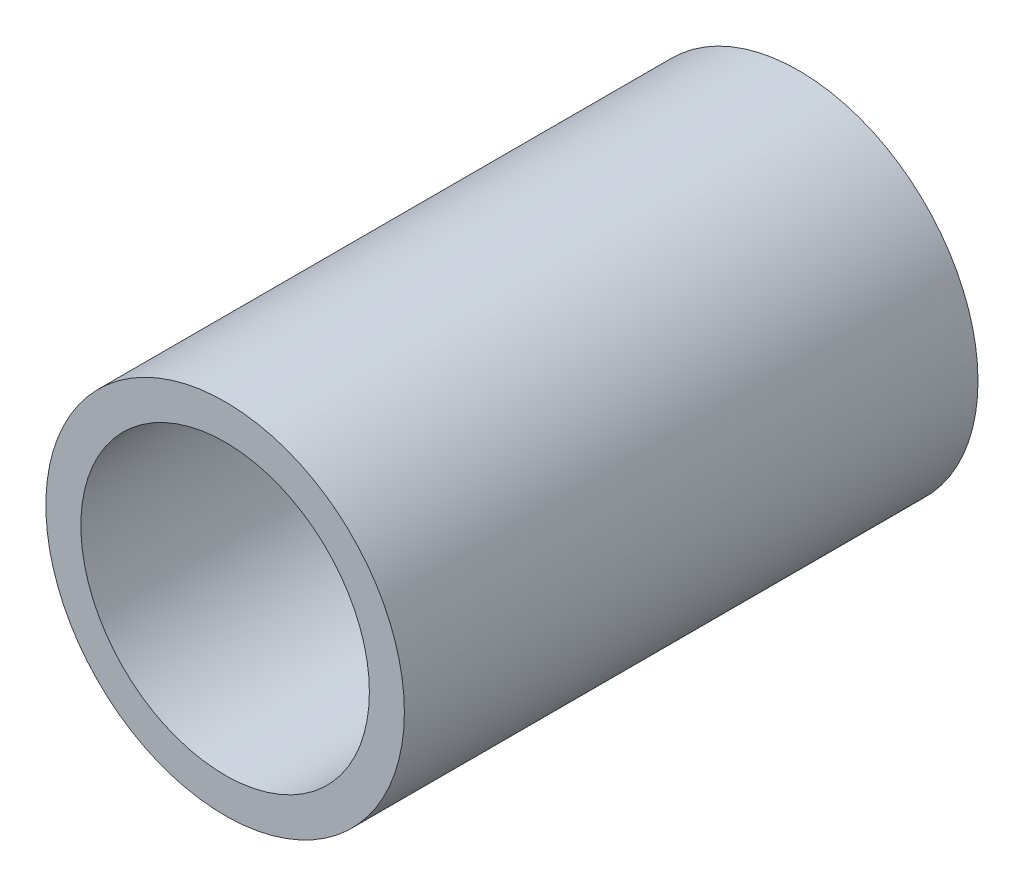
ISO-10303-21;
HEADER;
FILE_DESCRIPTION(('STEP AP214'),'2;1');
FILE_NAME('part.step','',(''),(''),'','','');
FILE_SCHEMA(('AUTOMOTIVE_DESIGN { 1 0 10303 214 1 1 1 1 }'));
ENDSEC;
DATA;
#1=APPLICATION_CONTEXT('core data for automotive mechanical design processes');
#2=APPLICATION_PROTOCOL_DEFINITION('international standard','automotive_design',2000,#1);
#3=PRODUCT_CONTEXT('',#1,'mechanical');
#4=PRODUCT('Part','Part','',(#3));
#5=PRODUCT_RELATED_PRODUCT_CATEGORY('part','',(#4));
#6=PRODUCT_DEFINITION_FORMATION('','',#4);
#7=PRODUCT_DEFINITION_CONTEXT('part definition',#1,'design');
#8=PRODUCT_DEFINITION('design','',#6,#7);
#9=PRODUCT_DEFINITION_SHAPE('','',#8);
#10=(LENGTH_UNIT() NAMED_UNIT(*) SI_UNIT(.MILLI.,.METRE.));
#11=(NAMED_UNIT(*) PLANE_ANGLE_UNIT() SI_UNIT($,.RADIAN.));
#12=(NAMED_UNIT(*) SI_UNIT($,.STERADIAN.) SOLID_ANGLE_UNIT());
#13=UNCERTAINTY_MEASURE_WITH_UNIT(LENGTH_MEASURE(1.E-05),#10,'distance_accuracy_value','');
#14=(GEOMETRIC_REPRESENTATION_CONTEXT(3) GLOBAL_UNCERTAINTY_ASSIGNED_CONTEXT((#13)) GLOBAL_UNIT_ASSIGNED_CONTEXT((#10,
#11,#12)) REPRESENTATION_CONTEXT('',''));
#15=CARTESIAN_POINT('',(0.,0.,0.));
#16=DIRECTION('',(0.,0.,1.));
#17=DIRECTION('',(1.,0.,0.));
#18=AXIS2_PLACEMENT_3D('',#15,#16,#17);
#19=CARTESIAN_POINT('',(0.,0.,12.7));
#20=DIRECTION('',(0.,0.,1.));
#21=DIRECTION('',(1.,0.,0.));
#22=AXIS2_PLACEMENT_3D('',#19,#20,#21);
#23=PLANE('',#22);
#24=CARTESIAN_POINT('',(0.,0.,12.7));
#25=DIRECTION('',(0.,0.,1.));
#26=DIRECTION('',(1.,0.,0.));
#27=AXIS2_PLACEMENT_3D('',#24,#25,#26);
#28=CIRCLE('',#27,7.9375);
#29=CARTESIAN_POINT('',(7.9375,0.,12.7));
#30=VERTEX_POINT('',#29);
#31=EDGE_CURVE('E10',#30,#30,#28,.T.);
#32=ORIENTED_EDGE('',*,*,#31,.T.);
#33=EDGE_LOOP('',(#32));
#34=FACE_BOUND('',#33,.T.);
#35=CARTESIAN_POINT('',(0.,0.,12.7));
#36=DIRECTION('',(0.,0.,1.));
#37=DIRECTION('',(1.,0.,0.));
#38=AXIS2_PLACEMENT_3D('',#35,#36,#37);
#39=CIRCLE('',#38,6.3881);
#40=CARTESIAN_POINT('',(6.3881,0.,12.7));
#41=VERTEX_POINT('',#40);
#42=EDGE_CURVE('E41',#41,#41,#39,.T.);
#43=ORIENTED_EDGE('',*,*,#42,.F.);
#44=EDGE_LOOP('',(#43));
#45=FACE_BOUND('',#44,.T.);
#46=ADVANCED_FACE('F30',(#34,#45),#23,.T.);
#47=CARTESIAN_POINT('',(0.,0.,-12.7));
#48=DIRECTION('',(0.,0.,1.));
#49=DIRECTION('',(1.,0.,0.));
#50=AXIS2_PLACEMENT_3D('',#47,#48,#49);
#51=PLANE('',#50);
#52=CARTESIAN_POINT('',(0.,0.,-12.7));
#53=DIRECTION('',(0.,0.,1.));
#54=DIRECTION('',(1.,0.,0.));
#55=AXIS2_PLACEMENT_3D('',#52,#53,#54);
#56=CIRCLE('',#55,7.9375);
#57=CARTESIAN_POINT('',(7.9375,0.,-12.7));
#58=VERTEX_POINT('',#57);
#59=EDGE_CURVE('E34',#58,#58,#56,.T.);
#60=ORIENTED_EDGE('',*,*,#59,.F.);
#61=EDGE_LOOP('',(#60));
#62=FACE_BOUND('',#61,.T.);
#63=CARTESIAN_POINT('',(0.,0.,-12.7));
#64=DIRECTION('',(0.,0.,1.));
#65=DIRECTION('',(1.,0.,0.));
#66=AXIS2_PLACEMENT_3D('',#63,#64,#65);
#67=CIRCLE('',#66,6.3881);
#68=CARTESIAN_POINT('',(6.3881,0.,-12.7));
#69=VERTEX_POINT('',#68);
#70=EDGE_CURVE('E43',#69,#69,#67,.T.);
#71=ORIENTED_EDGE('',*,*,#70,.T.);
#72=EDGE_LOOP('',(#71));
#73=FACE_BOUND('',#72,.T.);
#74=ADVANCED_FACE('F53',(#62,#73),#51,.F.);
#75=CARTESIAN_POINT('',(0.,0.,12.7));
#76=DIRECTION('',(0.,0.,-1.));
#77=DIRECTION('',(-1.,0.,0.));
#78=AXIS2_PLACEMENT_3D('',#75,#76,#77);
#79=CYLINDRICAL_SURFACE('',#78,7.9375);
#80=ORIENTED_EDGE('',*,*,#31,.F.);
#81=EDGE_LOOP('',(#80));
#82=FACE_BOUND('',#81,.T.);
#83=ORIENTED_EDGE('',*,*,#59,.T.);
#84=EDGE_LOOP('',(#83));
#85=FACE_BOUND('',#84,.T.);
#86=ADVANCED_FACE('F32',(#82,#85),#79,.T.);
#87=CARTESIAN_POINT('',(0.,0.,12.7));
#88=DIRECTION('',(0.,0.,-1.));
#89=DIRECTION('',(-1.,0.,0.));
#90=AXIS2_PLACEMENT_3D('',#87,#88,#89);
#91=CYLINDRICAL_SURFACE('',#90,6.3881);
#92=ORIENTED_EDGE('',*,*,#42,.T.);
#93=EDGE_LOOP('',(#92));
#94=FACE_BOUND('',#93,.T.);
#95=ORIENTED_EDGE('',*,*,#70,.F.);
#96=EDGE_LOOP('',(#95));
#97=FACE_BOUND('',#96,.T.);
#98=ADVANCED_FACE('F49',(#94,#97),#91,.F.);
#99=CLOSED_SHELL('',(#46,#74,#86,#98));
#100=MANIFOLD_SOLID_BREP('B2',#99);
#101=ADVANCED_BREP_SHAPE_REPRESENTATION('',(#18,#100),#14);
#102=SHAPE_DEFINITION_REPRESENTATION(#9,#101);
ENDSEC;
END-ISO-10303-21;
